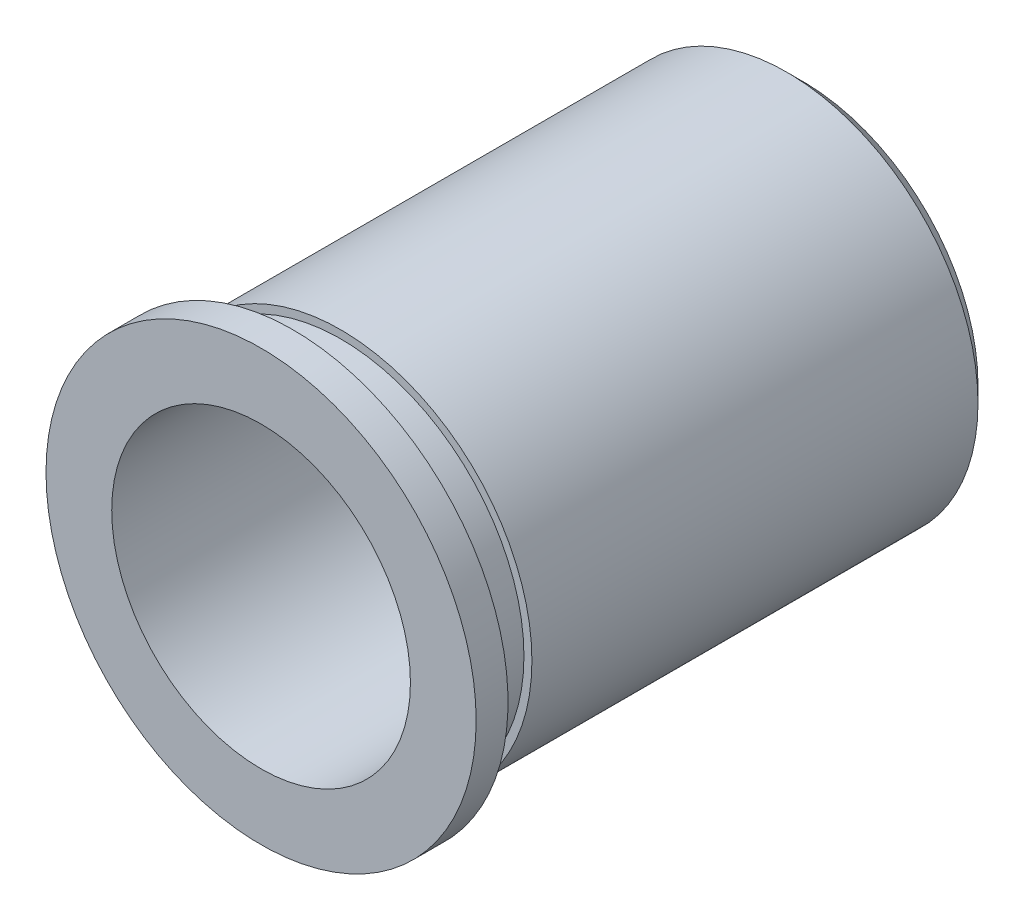
ISO-10303-21;
HEADER;
FILE_DESCRIPTION(('STEP AP214'),'2;1');
FILE_NAME('part.step','',(''),(''),'','','');
FILE_SCHEMA(('AUTOMOTIVE_DESIGN { 1 0 10303 214 1 1 1 1 }'));
ENDSEC;
DATA;
#1=APPLICATION_CONTEXT('core data for automotive mechanical design processes');
#2=APPLICATION_PROTOCOL_DEFINITION('international standard','automotive_design',2000,#1);
#3=PRODUCT_CONTEXT('',#1,'mechanical');
#4=PRODUCT('Part','Part','',(#3));
#5=PRODUCT_RELATED_PRODUCT_CATEGORY('part','',(#4));
#6=PRODUCT_DEFINITION_FORMATION('','',#4);
#7=PRODUCT_DEFINITION_CONTEXT('part definition',#1,'design');
#8=PRODUCT_DEFINITION('design','',#6,#7);
#9=PRODUCT_DEFINITION_SHAPE('','',#8);
#10=(LENGTH_UNIT() NAMED_UNIT(*) SI_UNIT(.MILLI.,.METRE.));
#11=(NAMED_UNIT(*) PLANE_ANGLE_UNIT() SI_UNIT($,.RADIAN.));
#12=(NAMED_UNIT(*) SI_UNIT($,.STERADIAN.) SOLID_ANGLE_UNIT());
#13=UNCERTAINTY_MEASURE_WITH_UNIT(LENGTH_MEASURE(1.E-05),#10,'distance_accuracy_value','');
#14=(GEOMETRIC_REPRESENTATION_CONTEXT(3) GLOBAL_UNCERTAINTY_ASSIGNED_CONTEXT((#13)) GLOBAL_UNIT_ASSIGNED_CONTEXT((#10,
#11,#12)) REPRESENTATION_CONTEXT('',''));
#15=CARTESIAN_POINT('',(0.,0.,0.));
#16=DIRECTION('',(0.,0.,1.));
#17=DIRECTION('',(1.,0.,0.));
#18=AXIS2_PLACEMENT_3D('',#15,#16,#17);
#19=CARTESIAN_POINT('',(0.,0.,8.636));
#20=DIRECTION('',(0.,0.,-1.));
#21=DIRECTION('',(-1.,0.,0.));
#22=AXIS2_PLACEMENT_3D('',#19,#20,#21);
#23=CYLINDRICAL_SURFACE('',#22,3.429);
#24=CARTESIAN_POINT('',(0.,0.,8.636));
#25=DIRECTION('',(0.,0.,1.));
#26=DIRECTION('',(1.,0.,0.));
#27=AXIS2_PLACEMENT_3D('',#24,#25,#26);
#28=CIRCLE('',#27,3.429);
#29=CARTESIAN_POINT('',(3.429,0.,8.636));
#30=VERTEX_POINT('',#29);
#31=EDGE_CURVE('E24',#30,#30,#28,.T.);
#32=ORIENTED_EDGE('',*,*,#31,.F.);
#33=EDGE_LOOP('',(#32));
#34=FACE_BOUND('',#33,.T.);
#35=CARTESIAN_POINT('',(0.,0.,8.128));
#36=DIRECTION('',(0.,0.,-1.));
#37=DIRECTION('',(-1.,0.,0.));
#38=AXIS2_PLACEMENT_3D('',#35,#36,#37);
#39=CIRCLE('',#38,3.429);
#40=CARTESIAN_POINT('',(-3.429,0.,8.128));
#41=VERTEX_POINT('',#40);
#42=EDGE_CURVE('E28',#41,#41,#39,.T.);
#43=ORIENTED_EDGE('',*,*,#42,.F.);
#44=EDGE_LOOP('',(#43));
#45=FACE_BOUND('',#44,.T.);
#46=ADVANCED_FACE('F13',(#34,#45),#23,.T.);
#47=CARTESIAN_POINT('',(0.,0.,8.636));
#48=DIRECTION('',(0.,0.,1.));
#49=DIRECTION('',(1.,0.,0.));
#50=AXIS2_PLACEMENT_3D('',#47,#48,#49);
#51=PLANE('',#50);
#52=CARTESIAN_POINT('',(0.,0.,8.636));
#53=DIRECTION('',(0.,0.,1.));
#54=DIRECTION('',(1.,0.,0.));
#55=AXIS2_PLACEMENT_3D('',#52,#53,#54);
#56=CIRCLE('',#55,2.38125);
#57=CARTESIAN_POINT('',(2.38125,0.,8.636));
#58=VERTEX_POINT('',#57);
#59=EDGE_CURVE('E43',#58,#58,#56,.T.);
#60=ORIENTED_EDGE('',*,*,#59,.F.);
#61=EDGE_LOOP('',(#60));
#62=FACE_BOUND('',#61,.T.);
#63=ORIENTED_EDGE('',*,*,#31,.T.);
#64=EDGE_LOOP('',(#63));
#65=FACE_BOUND('',#64,.T.);
#66=ADVANCED_FACE('F58',(#62,#65),#51,.T.);
#67=CARTESIAN_POINT('',(0.,0.,8.128));
#68=DIRECTION('',(0.,0.,-1.));
#69=DIRECTION('',(-1.,0.,0.));
#70=AXIS2_PLACEMENT_3D('',#67,#68,#69);
#71=PLANE('',#70);
#72=ORIENTED_EDGE('',*,*,#42,.T.);
#73=EDGE_LOOP('',(#72));
#74=FACE_BOUND('',#73,.T.);
#75=CARTESIAN_POINT('',(0.,0.,8.128));
#76=DIRECTION('',(0.,0.,1.));
#77=DIRECTION('',(1.,0.,0.));
#78=AXIS2_PLACEMENT_3D('',#75,#76,#77);
#79=CIRCLE('',#78,2.921);
#80=CARTESIAN_POINT('',(2.921,0.,8.128));
#81=VERTEX_POINT('',#80);
#82=EDGE_CURVE('E37',#81,#81,#79,.T.);
#83=ORIENTED_EDGE('',*,*,#82,.T.);
#84=EDGE_LOOP('',(#83));
#85=FACE_BOUND('',#84,.T.);
#86=ADVANCED_FACE('F61',(#74,#85),#71,.T.);
#87=CARTESIAN_POINT('',(0.,0.,7.366));
#88=DIRECTION('',(0.,0.,1.));
#89=DIRECTION('',(1.,0.,0.));
#90=AXIS2_PLACEMENT_3D('',#87,#88,#89);
#91=PLANE('',#90);
#92=CARTESIAN_POINT('',(0.,0.,7.366));
#93=DIRECTION('',(0.,0.,1.));
#94=DIRECTION('',(1.,0.,0.));
#95=AXIS2_PLACEMENT_3D('',#92,#93,#94);
#96=CIRCLE('',#95,3.048);
#97=CARTESIAN_POINT('',(3.048,0.,7.366));
#98=VERTEX_POINT('',#97);
#99=EDGE_CURVE('E31',#98,#98,#96,.F.);
#100=ORIENTED_EDGE('',*,*,#99,.F.);
#101=EDGE_LOOP('',(#100));
#102=FACE_BOUND('',#101,.T.);
#103=CARTESIAN_POINT('',(0.,0.,7.366));
#104=DIRECTION('',(0.,0.,1.));
#105=DIRECTION('',(1.,0.,0.));
#106=AXIS2_PLACEMENT_3D('',#103,#104,#105);
#107=CIRCLE('',#106,2.921);
#108=CARTESIAN_POINT('',(2.921,0.,7.366));
#109=VERTEX_POINT('',#108);
#110=EDGE_CURVE('E34',#109,#109,#107,.T.);
#111=ORIENTED_EDGE('',*,*,#110,.F.);
#112=EDGE_LOOP('',(#111));
#113=FACE_BOUND('',#112,.T.);
#114=ADVANCED_FACE('F71',(#102,#113),#91,.T.);
#115=CARTESIAN_POINT('',(0.,0.,7.366));
#116=DIRECTION('',(0.,0.,1.));
#117=DIRECTION('',(1.,0.,0.));
#118=AXIS2_PLACEMENT_3D('',#115,#116,#117);
#119=CYLINDRICAL_SURFACE('',#118,2.921);
#120=ORIENTED_EDGE('',*,*,#110,.T.);
#121=EDGE_LOOP('',(#120));
#122=FACE_BOUND('',#121,.T.);
#123=ORIENTED_EDGE('',*,*,#82,.F.);
#124=EDGE_LOOP('',(#123));
#125=FACE_BOUND('',#124,.T.);
#126=ADVANCED_FACE('F75',(#122,#125),#119,.T.);
#127=CARTESIAN_POINT('',(0.,0.,0.));
#128=DIRECTION('',(0.,0.,1.));
#129=DIRECTION('',(1.,0.,0.));
#130=AXIS2_PLACEMENT_3D('',#127,#128,#129);
#131=PLANE('',#130);
#132=CARTESIAN_POINT('',(0.,0.,0.));
#133=DIRECTION('',(0.,0.,1.));
#134=DIRECTION('',(1.,0.,0.));
#135=AXIS2_PLACEMENT_3D('',#132,#133,#134);
#136=CIRCLE('',#135,2.79399999999999);
#137=CARTESIAN_POINT('',(2.79399999999999,0.,0.));
#138=VERTEX_POINT('',#137);
#139=EDGE_CURVE('E20',#138,#138,#136,.F.);
#140=ORIENTED_EDGE('',*,*,#139,.T.);
#141=EDGE_LOOP('',(#140));
#142=FACE_BOUND('',#141,.T.);
#143=CARTESIAN_POINT('',(0.,0.,0.));
#144=DIRECTION('',(0.,0.,1.));
#145=DIRECTION('',(1.,0.,0.));
#146=AXIS2_PLACEMENT_3D('',#143,#144,#145);
#147=CIRCLE('',#146,2.38125);
#148=CARTESIAN_POINT('',(2.38125,0.,0.));
#149=VERTEX_POINT('',#148);
#150=EDGE_CURVE('E40',#149,#149,#147,.T.);
#151=ORIENTED_EDGE('',*,*,#150,.T.);
#152=EDGE_LOOP('',(#151));
#153=FACE_BOUND('',#152,.T.);
#154=ADVANCED_FACE('F49',(#142,#153),#131,.F.);
#155=CARTESIAN_POINT('',(0.,0.,8.128));
#156=DIRECTION('',(0.,0.,-1.));
#157=DIRECTION('',(-1.,0.,0.));
#158=AXIS2_PLACEMENT_3D('',#155,#156,#157);
#159=CYLINDRICAL_SURFACE('',#158,3.048);
#160=CARTESIAN_POINT('',(0.,0.,0.254000000000003));
#161=DIRECTION('',(0.,0.,1.));
#162=DIRECTION('',(1.,0.,0.));
#163=AXIS2_PLACEMENT_3D('',#160,#161,#162);
#164=CIRCLE('',#163,3.048);
#165=CARTESIAN_POINT('',(3.048,0.,0.254000000000003));
#166=VERTEX_POINT('',#165);
#167=EDGE_CURVE('E8',#166,#166,#164,.T.);
#168=ORIENTED_EDGE('',*,*,#167,.T.);
#169=EDGE_LOOP('',(#168));
#170=FACE_BOUND('',#169,.T.);
#171=ORIENTED_EDGE('',*,*,#99,.T.);
#172=EDGE_LOOP('',(#171));
#173=FACE_BOUND('',#172,.T.);
#174=ADVANCED_FACE('F54',(#170,#173),#159,.T.);
#175=CARTESIAN_POINT('',(0.,0.,0.));
#176=DIRECTION('',(0.,0.,1.));
#177=DIRECTION('',(1.,0.,0.));
#178=AXIS2_PLACEMENT_3D('',#175,#176,#177);
#179=CYLINDRICAL_SURFACE('',#178,2.38125);
#180=ORIENTED_EDGE('',*,*,#150,.F.);
#181=EDGE_LOOP('',(#180));
#182=FACE_BOUND('',#181,.T.);
#183=ORIENTED_EDGE('',*,*,#59,.T.);
#184=EDGE_LOOP('',(#183));
#185=FACE_BOUND('',#184,.T.);
#186=ADVANCED_FACE('F51',(#182,#185),#179,.F.);
#187=CARTESIAN_POINT('',(0.,0.,0.));
#188=DIRECTION('',(0.,0.,1.));
#189=DIRECTION('',(1.,0.,0.));
#190=AXIS2_PLACEMENT_3D('',#187,#188,#189);
#191=CONICAL_SURFACE('',#190,2.79399999999999,0.785398163397454);
#192=ORIENTED_EDGE('',*,*,#167,.F.);
#193=EDGE_LOOP('',(#192));
#194=FACE_BOUND('',#193,.T.);
#195=ORIENTED_EDGE('',*,*,#139,.F.);
#196=EDGE_LOOP('',(#195));
#197=FACE_BOUND('',#196,.T.);
#198=ADVANCED_FACE('F15',(#194,#197),#191,.T.);
#199=CLOSED_SHELL('',(#46,#66,#86,#114,#126,#154,#174,#186,#198));
#200=MANIFOLD_SOLID_BREP('B1',#199);
#201=ADVANCED_BREP_SHAPE_REPRESENTATION('',(#18,#200),#14);
#202=SHAPE_DEFINITION_REPRESENTATION(#9,#201);
ENDSEC;
END-ISO-10303-21;
